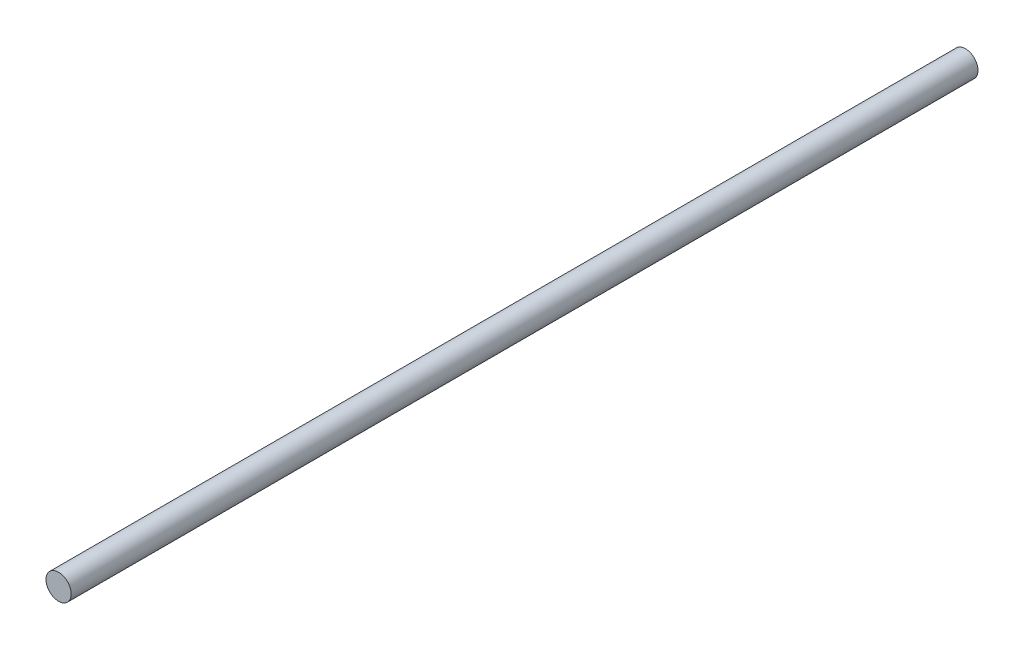
ISO-10303-21;
HEADER;
FILE_DESCRIPTION(('STEP AP214'),'2;1');
FILE_NAME('part.step','',(''),(''),'','','');
FILE_SCHEMA(('AUTOMOTIVE_DESIGN { 1 0 10303 214 1 1 1 1 }'));
ENDSEC;
DATA;
#1=APPLICATION_CONTEXT('core data for automotive mechanical design processes');
#2=APPLICATION_PROTOCOL_DEFINITION('international standard','automotive_design',2000,#1);
#3=PRODUCT_CONTEXT('',#1,'mechanical');
#4=PRODUCT('Part','Part','',(#3));
#5=PRODUCT_RELATED_PRODUCT_CATEGORY('part','',(#4));
#6=PRODUCT_DEFINITION_FORMATION('','',#4);
#7=PRODUCT_DEFINITION_CONTEXT('part definition',#1,'design');
#8=PRODUCT_DEFINITION('design','',#6,#7);
#9=PRODUCT_DEFINITION_SHAPE('','',#8);
#10=(LENGTH_UNIT() NAMED_UNIT(*) SI_UNIT(.MILLI.,.METRE.));
#11=(NAMED_UNIT(*) PLANE_ANGLE_UNIT() SI_UNIT($,.RADIAN.));
#12=(NAMED_UNIT(*) SI_UNIT($,.STERADIAN.) SOLID_ANGLE_UNIT());
#13=UNCERTAINTY_MEASURE_WITH_UNIT(LENGTH_MEASURE(1.E-05),#10,'distance_accuracy_value','');
#14=(GEOMETRIC_REPRESENTATION_CONTEXT(3) GLOBAL_UNCERTAINTY_ASSIGNED_CONTEXT((#13)) GLOBAL_UNIT_ASSIGNED_CONTEXT((#10,
#11,#12)) REPRESENTATION_CONTEXT('',''));
#15=CARTESIAN_POINT('',(0.,0.,0.));
#16=DIRECTION('',(0.,0.,1.));
#17=DIRECTION('',(1.,0.,0.));
#18=AXIS2_PLACEMENT_3D('',#15,#16,#17);
#19=CARTESIAN_POINT('',(0.,0.,114.3));
#20=DIRECTION('',(0.,0.,-1.));
#21=DIRECTION('',(-1.,0.,0.));
#22=AXIS2_PLACEMENT_3D('',#19,#20,#21);
#23=CYLINDRICAL_SURFACE('',#22,3.175);
#24=CARTESIAN_POINT('',(0.,0.,114.3));
#25=DIRECTION('',(0.,0.,1.));
#26=DIRECTION('',(1.,0.,0.));
#27=AXIS2_PLACEMENT_3D('',#24,#25,#26);
#28=CIRCLE('',#27,3.175);
#29=CARTESIAN_POINT('',(3.175,0.,114.3));
#30=VERTEX_POINT('',#29);
#31=EDGE_CURVE('E10',#30,#30,#28,.T.);
#32=ORIENTED_EDGE('',*,*,#31,.F.);
#33=EDGE_LOOP('',(#32));
#34=FACE_BOUND('',#33,.T.);
#35=CARTESIAN_POINT('',(0.,0.,-114.3));
#36=DIRECTION('',(0.,0.,1.));
#37=DIRECTION('',(1.,0.,0.));
#38=AXIS2_PLACEMENT_3D('',#35,#36,#37);
#39=CIRCLE('',#38,3.175);
#40=CARTESIAN_POINT('',(3.175,0.,-114.3));
#41=VERTEX_POINT('',#40);
#42=EDGE_CURVE('E37',#41,#41,#39,.T.);
#43=ORIENTED_EDGE('',*,*,#42,.T.);
#44=EDGE_LOOP('',(#43));
#45=FACE_BOUND('',#44,.T.);
#46=ADVANCED_FACE('F34',(#34,#45),#23,.T.);
#47=CARTESIAN_POINT('',(0.,0.,114.3));
#48=DIRECTION('',(0.,0.,1.));
#49=DIRECTION('',(1.,0.,0.));
#50=AXIS2_PLACEMENT_3D('',#47,#48,#49);
#51=PLANE('',#50);
#52=ORIENTED_EDGE('',*,*,#31,.T.);
#53=EDGE_LOOP('',(#52));
#54=FACE_BOUND('',#53,.T.);
#55=ADVANCED_FACE('F49',(#54),#51,.T.);
#56=CARTESIAN_POINT('',(0.,0.,-114.3));
#57=DIRECTION('',(0.,0.,1.));
#58=DIRECTION('',(1.,0.,0.));
#59=AXIS2_PLACEMENT_3D('',#56,#57,#58);
#60=PLANE('',#59);
#61=ORIENTED_EDGE('',*,*,#42,.F.);
#62=EDGE_LOOP('',(#61));
#63=FACE_BOUND('',#62,.T.);
#64=ADVANCED_FACE('F47',(#63),#60,.F.);
#65=CLOSED_SHELL('',(#46,#55,#64));
#66=MANIFOLD_SOLID_BREP('B2',#65);
#67=ADVANCED_BREP_SHAPE_REPRESENTATION('',(#18,#66),#14);
#68=SHAPE_DEFINITION_REPRESENTATION(#9,#67);
ENDSEC;
END-ISO-10303-21;
